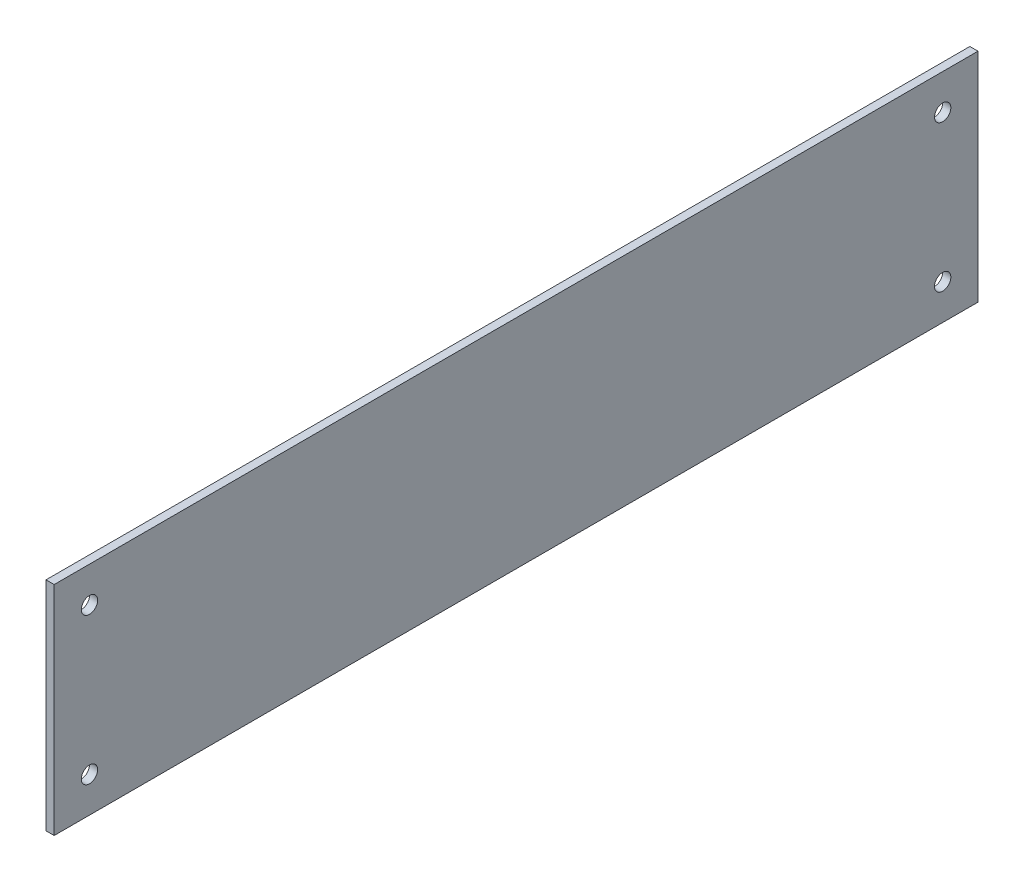
ISO-10303-21;
HEADER;
FILE_DESCRIPTION(('STEP AP214'),'2;1');
FILE_NAME('part.step','',(''),(''),'','','');
FILE_SCHEMA(('AUTOMOTIVE_DESIGN { 1 0 10303 214 1 1 1 1 }'));
ENDSEC;
DATA;
#1=APPLICATION_CONTEXT('core data for automotive mechanical design processes');
#2=APPLICATION_PROTOCOL_DEFINITION('international standard','automotive_design',2000,#1);
#3=PRODUCT_CONTEXT('',#1,'mechanical');
#4=PRODUCT('Part','Part','',(#3));
#5=PRODUCT_RELATED_PRODUCT_CATEGORY('part','',(#4));
#6=PRODUCT_DEFINITION_FORMATION('','',#4);
#7=PRODUCT_DEFINITION_CONTEXT('part definition',#1,'design');
#8=PRODUCT_DEFINITION('design','',#6,#7);
#9=PRODUCT_DEFINITION_SHAPE('','',#8);
#10=(LENGTH_UNIT() NAMED_UNIT(*) SI_UNIT(.MILLI.,.METRE.));
#11=(NAMED_UNIT(*) PLANE_ANGLE_UNIT() SI_UNIT($,.RADIAN.));
#12=(NAMED_UNIT(*) SI_UNIT($,.STERADIAN.) SOLID_ANGLE_UNIT());
#13=UNCERTAINTY_MEASURE_WITH_UNIT(LENGTH_MEASURE(1.E-05),#10,'distance_accuracy_value','');
#14=(GEOMETRIC_REPRESENTATION_CONTEXT(3) GLOBAL_UNCERTAINTY_ASSIGNED_CONTEXT((#13)) GLOBAL_UNIT_ASSIGNED_CONTEXT((#10,
#11,#12)) REPRESENTATION_CONTEXT('',''));
#15=CARTESIAN_POINT('',(0.,0.,0.));
#16=DIRECTION('',(0.,0.,1.));
#17=DIRECTION('',(1.,0.,0.));
#18=AXIS2_PLACEMENT_3D('',#15,#16,#17);
#19=CARTESIAN_POINT('',(1.5,0.,0.));
#20=DIRECTION('',(-1.,0.,0.));
#21=DIRECTION('',(0.,0.,1.));
#22=AXIS2_PLACEMENT_3D('',#19,#20,#21);
#23=PLANE('',#22);
#24=CARTESIAN_POINT('',(1.5,33.5,-163.5));
#25=DIRECTION('',(-1.,0.,0.));
#26=DIRECTION('',(0.,0.,1.));
#27=AXIS2_PLACEMENT_3D('',#24,#25,#26);
#28=CIRCLE('',#27,1.5);
#29=CARTESIAN_POINT('',(1.5,33.5,-162.));
#30=VERTEX_POINT('',#29);
#31=EDGE_CURVE('E115',#30,#30,#28,.F.);
#32=ORIENTED_EDGE('',*,*,#31,.F.);
#33=EDGE_LOOP('',(#32));
#34=FACE_BOUND('',#33,.T.);
#35=CARTESIAN_POINT('',(1.5,6.5,-6.5));
#36=DIRECTION('',(-1.,0.,0.));
#37=DIRECTION('',(0.,0.,1.));
#38=AXIS2_PLACEMENT_3D('',#35,#36,#37);
#39=CIRCLE('',#38,1.5);
#40=CARTESIAN_POINT('',(1.5,6.5,-5.));
#41=VERTEX_POINT('',#40);
#42=EDGE_CURVE('E103',#41,#41,#39,.F.);
#43=ORIENTED_EDGE('',*,*,#42,.F.);
#44=EDGE_LOOP('',(#43));
#45=FACE_BOUND('',#44,.T.);
#46=DIRECTION('',(0.,-1.,0.));
#47=VECTOR('',#46,1.);
#48=CARTESIAN_POINT('',(1.5,0.,0.));
#49=LINE('',#48,#47);
#50=CARTESIAN_POINT('',(1.5,40.,0.));
#51=VERTEX_POINT('',#50);
#52=CARTESIAN_POINT('',(1.5,0.,0.));
#53=VERTEX_POINT('',#52);
#54=EDGE_CURVE('E87',#51,#53,#49,.T.);
#55=ORIENTED_EDGE('',*,*,#54,.T.);
#56=DIRECTION('',(0.,0.,-1.));
#57=VECTOR('',#56,1.);
#58=CARTESIAN_POINT('',(1.5,0.,0.));
#59=LINE('',#58,#57);
#60=CARTESIAN_POINT('',(1.5,0.,-170.));
#61=VERTEX_POINT('',#60);
#62=EDGE_CURVE('E82',#53,#61,#59,.T.);
#63=ORIENTED_EDGE('',*,*,#62,.T.);
#64=DIRECTION('',(0.,1.,0.));
#65=VECTOR('',#64,1.);
#66=CARTESIAN_POINT('',(1.5,0.,-170.));
#67=LINE('',#66,#65);
#68=CARTESIAN_POINT('',(1.5,40.,-170.));
#69=VERTEX_POINT('',#68);
#70=EDGE_CURVE('E85',#61,#69,#67,.T.);
#71=ORIENTED_EDGE('',*,*,#70,.T.);
#72=DIRECTION('',(0.,0.,1.));
#73=VECTOR('',#72,1.);
#74=CARTESIAN_POINT('',(1.5,40.,0.));
#75=LINE('',#74,#73);
#76=EDGE_CURVE('E52',#69,#51,#75,.T.);
#77=ORIENTED_EDGE('',*,*,#76,.T.);
#78=EDGE_LOOP('',(#55,#63,#71,#77));
#79=FACE_BOUND('',#78,.T.);
#80=CARTESIAN_POINT('',(1.5,6.5,-163.5));
#81=DIRECTION('',(-1.,0.,0.));
#82=DIRECTION('',(0.,0.,1.));
#83=AXIS2_PLACEMENT_3D('',#80,#81,#82);
#84=CIRCLE('',#83,1.5);
#85=CARTESIAN_POINT('',(1.5,6.5,-162.));
#86=VERTEX_POINT('',#85);
#87=EDGE_CURVE('E112',#86,#86,#84,.F.);
#88=ORIENTED_EDGE('',*,*,#87,.F.);
#89=EDGE_LOOP('',(#88));
#90=FACE_BOUND('',#89,.T.);
#91=CARTESIAN_POINT('',(1.5,33.5,-6.5));
#92=DIRECTION('',(-1.,0.,0.));
#93=DIRECTION('',(0.,0.,1.));
#94=AXIS2_PLACEMENT_3D('',#91,#92,#93);
#95=CIRCLE('',#94,1.5);
#96=CARTESIAN_POINT('',(1.5,33.5,-5.));
#97=VERTEX_POINT('',#96);
#98=EDGE_CURVE('E118',#97,#97,#95,.F.);
#99=ORIENTED_EDGE('',*,*,#98,.F.);
#100=EDGE_LOOP('',(#99));
#101=FACE_BOUND('',#100,.T.);
#102=ADVANCED_FACE('F33',(#34,#45,#79,#90,#101),#23,.F.);
#103=CARTESIAN_POINT('',(0.,0.,0.));
#104=DIRECTION('',(-1.,0.,0.));
#105=DIRECTION('',(0.,0.,1.));
#106=AXIS2_PLACEMENT_3D('',#103,#104,#105);
#107=PLANE('',#106);
#108=CARTESIAN_POINT('',(0.,33.5,-163.5));
#109=DIRECTION('',(-1.,0.,0.));
#110=DIRECTION('',(0.,0.,1.));
#111=AXIS2_PLACEMENT_3D('',#108,#109,#110);
#112=CIRCLE('',#111,1.5);
#113=CARTESIAN_POINT('',(0.,33.5,-162.));
#114=VERTEX_POINT('',#113);
#115=EDGE_CURVE('E116',#114,#114,#112,.F.);
#116=ORIENTED_EDGE('',*,*,#115,.T.);
#117=EDGE_LOOP('',(#116));
#118=FACE_BOUND('',#117,.T.);
#119=CARTESIAN_POINT('',(0.,6.5,-6.5));
#120=DIRECTION('',(-1.,0.,0.));
#121=DIRECTION('',(0.,0.,1.));
#122=AXIS2_PLACEMENT_3D('',#119,#120,#121);
#123=CIRCLE('',#122,1.5);
#124=CARTESIAN_POINT('',(0.,6.5,-5.));
#125=VERTEX_POINT('',#124);
#126=EDGE_CURVE('E109',#125,#125,#123,.F.);
#127=ORIENTED_EDGE('',*,*,#126,.T.);
#128=EDGE_LOOP('',(#127));
#129=FACE_BOUND('',#128,.T.);
#130=DIRECTION('',(0.,-1.,0.));
#131=VECTOR('',#130,1.);
#132=CARTESIAN_POINT('',(0.,0.,0.));
#133=LINE('',#132,#131);
#134=CARTESIAN_POINT('',(0.,40.,0.));
#135=VERTEX_POINT('',#134);
#136=CARTESIAN_POINT('',(0.,0.,0.));
#137=VERTEX_POINT('',#136);
#138=EDGE_CURVE('E100',#135,#137,#133,.T.);
#139=ORIENTED_EDGE('',*,*,#138,.F.);
#140=DIRECTION('',(0.,0.,1.));
#141=VECTOR('',#140,1.);
#142=CARTESIAN_POINT('',(0.,40.,0.));
#143=LINE('',#142,#141);
#144=CARTESIAN_POINT('',(0.,40.,-170.));
#145=VERTEX_POINT('',#144);
#146=EDGE_CURVE('E75',#145,#135,#143,.T.);
#147=ORIENTED_EDGE('',*,*,#146,.F.);
#148=DIRECTION('',(0.,1.,0.));
#149=VECTOR('',#148,1.);
#150=CARTESIAN_POINT('',(0.,0.,-170.));
#151=LINE('',#150,#149);
#152=CARTESIAN_POINT('',(0.,0.,-170.));
#153=VERTEX_POINT('',#152);
#154=EDGE_CURVE('E69',#153,#145,#151,.T.);
#155=ORIENTED_EDGE('',*,*,#154,.F.);
#156=DIRECTION('',(0.,0.,-1.));
#157=VECTOR('',#156,1.);
#158=CARTESIAN_POINT('',(0.,0.,0.));
#159=LINE('',#158,#157);
#160=EDGE_CURVE('E91',#137,#153,#159,.T.);
#161=ORIENTED_EDGE('',*,*,#160,.F.);
#162=EDGE_LOOP('',(#139,#147,#155,#161));
#163=FACE_BOUND('',#162,.T.);
#164=CARTESIAN_POINT('',(0.,6.5,-163.5));
#165=DIRECTION('',(-1.,0.,0.));
#166=DIRECTION('',(0.,0.,1.));
#167=AXIS2_PLACEMENT_3D('',#164,#165,#166);
#168=CIRCLE('',#167,1.5);
#169=CARTESIAN_POINT('',(0.,6.5,-162.));
#170=VERTEX_POINT('',#169);
#171=EDGE_CURVE('E113',#170,#170,#168,.F.);
#172=ORIENTED_EDGE('',*,*,#171,.T.);
#173=EDGE_LOOP('',(#172));
#174=FACE_BOUND('',#173,.T.);
#175=CARTESIAN_POINT('',(0.,33.5,-6.5));
#176=DIRECTION('',(-1.,0.,0.));
#177=DIRECTION('',(0.,0.,1.));
#178=AXIS2_PLACEMENT_3D('',#175,#176,#177);
#179=CIRCLE('',#178,1.5);
#180=CARTESIAN_POINT('',(0.,33.5,-5.));
#181=VERTEX_POINT('',#180);
#182=EDGE_CURVE('E37',#181,#181,#179,.F.);
#183=ORIENTED_EDGE('',*,*,#182,.T.);
#184=EDGE_LOOP('',(#183));
#185=FACE_BOUND('',#184,.T.);
#186=ADVANCED_FACE('F137',(#118,#129,#163,#174,#185),#107,.T.);
#187=CARTESIAN_POINT('',(1.5,0.,0.));
#188=DIRECTION('',(0.,0.,-1.));
#189=DIRECTION('',(-1.,0.,0.));
#190=AXIS2_PLACEMENT_3D('',#187,#188,#189);
#191=PLANE('',#190);
#192=ORIENTED_EDGE('',*,*,#138,.T.);
#193=DIRECTION('',(-1.,0.,0.));
#194=VECTOR('',#193,1.);
#195=CARTESIAN_POINT('',(1.5,0.,0.));
#196=LINE('',#195,#194);
#197=EDGE_CURVE('E11',#53,#137,#196,.T.);
#198=ORIENTED_EDGE('',*,*,#197,.F.);
#199=ORIENTED_EDGE('',*,*,#54,.F.);
#200=DIRECTION('',(-1.,0.,0.));
#201=VECTOR('',#200,1.);
#202=CARTESIAN_POINT('',(1.5,40.,0.));
#203=LINE('',#202,#201);
#204=EDGE_CURVE('E96',#51,#135,#203,.T.);
#205=ORIENTED_EDGE('',*,*,#204,.T.);
#206=EDGE_LOOP('',(#192,#198,#199,#205));
#207=FACE_BOUND('',#206,.T.);
#208=ADVANCED_FACE('F35',(#207),#191,.F.);
#209=CARTESIAN_POINT('',(1.5,0.,0.));
#210=DIRECTION('',(0.,1.,0.));
#211=DIRECTION('',(0.,0.,1.));
#212=AXIS2_PLACEMENT_3D('',#209,#210,#211);
#213=PLANE('',#212);
#214=ORIENTED_EDGE('',*,*,#160,.T.);
#215=DIRECTION('',(-1.,0.,0.));
#216=VECTOR('',#215,1.);
#217=CARTESIAN_POINT('',(1.5,0.,-170.));
#218=LINE('',#217,#216);
#219=EDGE_CURVE('E43',#61,#153,#218,.T.);
#220=ORIENTED_EDGE('',*,*,#219,.F.);
#221=ORIENTED_EDGE('',*,*,#62,.F.);
#222=ORIENTED_EDGE('',*,*,#197,.T.);
#223=EDGE_LOOP('',(#214,#220,#221,#222));
#224=FACE_BOUND('',#223,.T.);
#225=ADVANCED_FACE('F90',(#224),#213,.F.);
#226=CARTESIAN_POINT('',(1.5,0.,-170.));
#227=DIRECTION('',(0.,0.,1.));
#228=DIRECTION('',(1.,0.,0.));
#229=AXIS2_PLACEMENT_3D('',#226,#227,#228);
#230=PLANE('',#229);
#231=ORIENTED_EDGE('',*,*,#154,.T.);
#232=DIRECTION('',(-1.,0.,0.));
#233=VECTOR('',#232,1.);
#234=CARTESIAN_POINT('',(1.5,40.,-170.));
#235=LINE('',#234,#233);
#236=EDGE_CURVE('E92',#69,#145,#235,.T.);
#237=ORIENTED_EDGE('',*,*,#236,.F.);
#238=ORIENTED_EDGE('',*,*,#70,.F.);
#239=ORIENTED_EDGE('',*,*,#219,.T.);
#240=EDGE_LOOP('',(#231,#237,#238,#239));
#241=FACE_BOUND('',#240,.T.);
#242=ADVANCED_FACE('F94',(#241),#230,.F.);
#243=CARTESIAN_POINT('',(1.5,40.,0.));
#244=DIRECTION('',(0.,-1.,0.));
#245=DIRECTION('',(0.,0.,-1.));
#246=AXIS2_PLACEMENT_3D('',#243,#244,#245);
#247=PLANE('',#246);
#248=ORIENTED_EDGE('',*,*,#146,.T.);
#249=ORIENTED_EDGE('',*,*,#204,.F.);
#250=ORIENTED_EDGE('',*,*,#76,.F.);
#251=ORIENTED_EDGE('',*,*,#236,.T.);
#252=EDGE_LOOP('',(#248,#249,#250,#251));
#253=FACE_BOUND('',#252,.T.);
#254=ADVANCED_FACE('F149',(#253),#247,.F.);
#255=CARTESIAN_POINT('',(16.5,6.5,-6.5));
#256=DIRECTION('',(-1.,0.,0.));
#257=DIRECTION('',(0.,0.,1.));
#258=AXIS2_PLACEMENT_3D('',#255,#256,#257);
#259=CYLINDRICAL_SURFACE('',#258,1.5);
#260=ORIENTED_EDGE('',*,*,#126,.F.);
#261=EDGE_LOOP('',(#260));
#262=FACE_BOUND('',#261,.T.);
#263=ORIENTED_EDGE('',*,*,#42,.T.);
#264=EDGE_LOOP('',(#263));
#265=FACE_BOUND('',#264,.T.);
#266=ADVANCED_FACE('F134',(#262,#265),#259,.F.);
#267=CARTESIAN_POINT('',(16.5,6.5,-163.5));
#268=DIRECTION('',(-1.,0.,0.));
#269=DIRECTION('',(0.,0.,1.));
#270=AXIS2_PLACEMENT_3D('',#267,#268,#269);
#271=CYLINDRICAL_SURFACE('',#270,1.5);
#272=ORIENTED_EDGE('',*,*,#171,.F.);
#273=EDGE_LOOP('',(#272));
#274=FACE_BOUND('',#273,.T.);
#275=ORIENTED_EDGE('',*,*,#87,.T.);
#276=EDGE_LOOP('',(#275));
#277=FACE_BOUND('',#276,.T.);
#278=ADVANCED_FACE('F174',(#274,#277),#271,.F.);
#279=CARTESIAN_POINT('',(16.5,33.5,-163.5));
#280=DIRECTION('',(-1.,0.,0.));
#281=DIRECTION('',(0.,0.,1.));
#282=AXIS2_PLACEMENT_3D('',#279,#280,#281);
#283=CYLINDRICAL_SURFACE('',#282,1.5);
#284=ORIENTED_EDGE('',*,*,#115,.F.);
#285=EDGE_LOOP('',(#284));
#286=FACE_BOUND('',#285,.T.);
#287=ORIENTED_EDGE('',*,*,#31,.T.);
#288=EDGE_LOOP('',(#287));
#289=FACE_BOUND('',#288,.T.);
#290=ADVANCED_FACE('F169',(#286,#289),#283,.F.);
#291=CARTESIAN_POINT('',(16.5,33.5,-6.5));
#292=DIRECTION('',(-1.,0.,0.));
#293=DIRECTION('',(0.,0.,1.));
#294=AXIS2_PLACEMENT_3D('',#291,#292,#293);
#295=CYLINDRICAL_SURFACE('',#294,1.5);
#296=ORIENTED_EDGE('',*,*,#182,.F.);
#297=EDGE_LOOP('',(#296));
#298=FACE_BOUND('',#297,.T.);
#299=ORIENTED_EDGE('',*,*,#98,.T.);
#300=EDGE_LOOP('',(#299));
#301=FACE_BOUND('',#300,.T.);
#302=ADVANCED_FACE('F167',(#298,#301),#295,.F.);
#303=CLOSED_SHELL('',(#102,#186,#208,#225,#242,#254,#266,#278,#290,#302));
#304=MANIFOLD_SOLID_BREP('B2',#303);
#305=ADVANCED_BREP_SHAPE_REPRESENTATION('',(#18,#304),#14);
#306=SHAPE_DEFINITION_REPRESENTATION(#9,#305);
ENDSEC;
END-ISO-10303-21;
